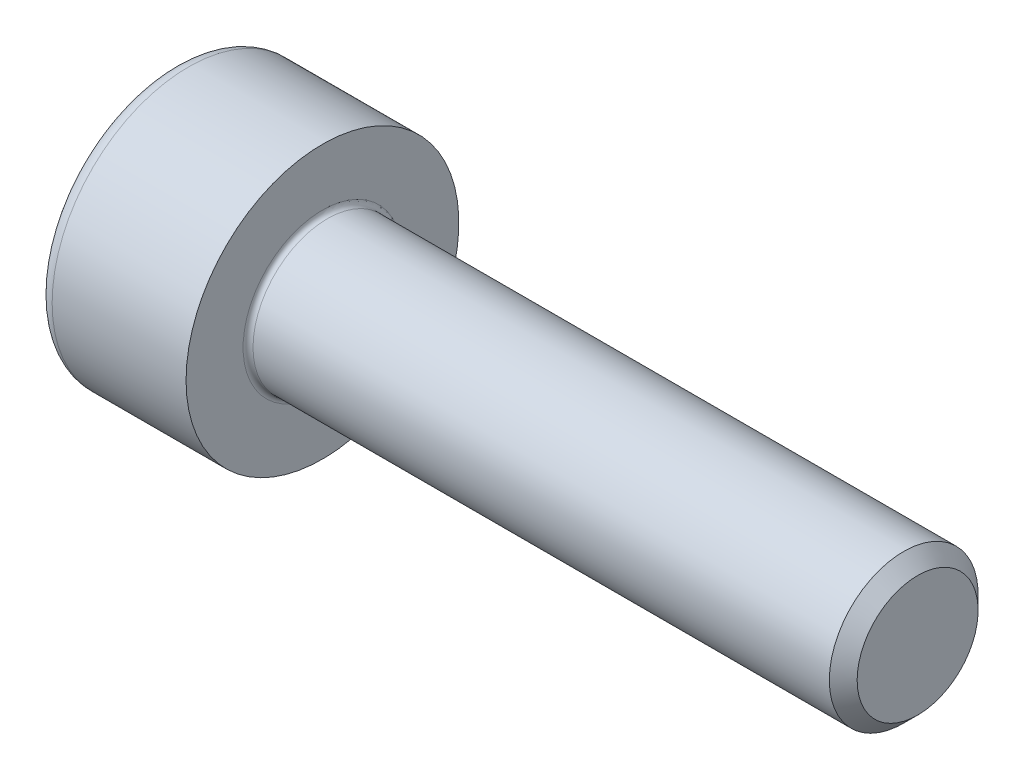
ISO-10303-21;
HEADER;
FILE_DESCRIPTION(('STEP AP214'),'2;1');
FILE_NAME('part.step','',(''),(''),'','','');
FILE_SCHEMA(('AUTOMOTIVE_DESIGN { 1 0 10303 214 1 1 1 1 }'));
ENDSEC;
DATA;
#1=APPLICATION_CONTEXT('core data for automotive mechanical design processes');
#2=APPLICATION_PROTOCOL_DEFINITION('international standard','automotive_design',2000,#1);
#3=PRODUCT_CONTEXT('',#1,'mechanical');
#4=PRODUCT('Part','Part','',(#3));
#5=PRODUCT_RELATED_PRODUCT_CATEGORY('part','',(#4));
#6=PRODUCT_DEFINITION_FORMATION('','',#4);
#7=PRODUCT_DEFINITION_CONTEXT('part definition',#1,'design');
#8=PRODUCT_DEFINITION('design','',#6,#7);
#9=PRODUCT_DEFINITION_SHAPE('','',#8);
#10=(LENGTH_UNIT() NAMED_UNIT(*) SI_UNIT(.MILLI.,.METRE.));
#11=(NAMED_UNIT(*) PLANE_ANGLE_UNIT() SI_UNIT($,.RADIAN.));
#12=(NAMED_UNIT(*) SI_UNIT($,.STERADIAN.) SOLID_ANGLE_UNIT());
#13=UNCERTAINTY_MEASURE_WITH_UNIT(LENGTH_MEASURE(1.E-05),#10,'distance_accuracy_value','');
#14=(GEOMETRIC_REPRESENTATION_CONTEXT(3) GLOBAL_UNCERTAINTY_ASSIGNED_CONTEXT((#13)) GLOBAL_UNIT_ASSIGNED_CONTEXT((#10,
#11,#12)) REPRESENTATION_CONTEXT('',''));
#15=CARTESIAN_POINT('',(0.,0.,0.));
#16=DIRECTION('',(0.,0.,1.));
#17=DIRECTION('',(1.,0.,0.));
#18=AXIS2_PLACEMENT_3D('',#15,#16,#17);
#19=CARTESIAN_POINT('',(0.,0.,0.));
#20=DIRECTION('',(-1.,0.,0.));
#21=DIRECTION('',(0.,0.,1.));
#22=AXIS2_PLACEMENT_3D('',#19,#20,#21);
#23=PLANE('',#22);
#24=DIRECTION('',(0.,-0.499999999999999,0.866025403784439));
#25=VECTOR('',#24,1.);
#26=CARTESIAN_POINT('',(0.,1.45492267835785,0.));
#27=LINE('',#26,#25);
#28=CARTESIAN_POINT('',(0.,1.45492267835785,0.));
#29=VERTEX_POINT('',#28);
#30=CARTESIAN_POINT('',(0.,0.727461339178922,1.26));
#31=VERTEX_POINT('',#30);
#32=EDGE_CURVE('E262',#29,#31,#27,.T.);
#33=ORIENTED_EDGE('',*,*,#32,.T.);
#34=DIRECTION('',(0.,1.,0.));
#35=VECTOR('',#34,1.);
#36=CARTESIAN_POINT('',(0.,-0.727461339178934,1.26));
#37=LINE('',#36,#35);
#38=CARTESIAN_POINT('',(0.,-0.727461339178934,1.26));
#39=VERTEX_POINT('',#38);
#40=EDGE_CURVE('E134',#39,#31,#37,.T.);
#41=ORIENTED_EDGE('',*,*,#40,.F.);
#42=DIRECTION('',(0.,-0.500000000000001,-0.866025403784438));
#43=VECTOR('',#42,1.);
#44=CARTESIAN_POINT('',(0.,-0.727461339178934,1.26));
#45=LINE('',#44,#43);
#46=CARTESIAN_POINT('',(0.,-1.45492267835786,0.));
#47=VERTEX_POINT('',#46);
#48=EDGE_CURVE('E265',#39,#47,#45,.T.);
#49=ORIENTED_EDGE('',*,*,#48,.T.);
#50=DIRECTION('',(0.,0.499999999999998,-0.86602540378444));
#51=VECTOR('',#50,1.);
#52=CARTESIAN_POINT('',(0.,-1.45492267835786,0.));
#53=LINE('',#52,#51);
#54=CARTESIAN_POINT('',(0.,-0.727461339178938,-1.26));
#55=VERTEX_POINT('',#54);
#56=EDGE_CURVE('E268',#47,#55,#53,.T.);
#57=ORIENTED_EDGE('',*,*,#56,.T.);
#58=DIRECTION('',(0.,-1.,0.));
#59=VECTOR('',#58,1.);
#60=CARTESIAN_POINT('',(0.,0.727461339178918,-1.26));
#61=LINE('',#60,#59);
#62=CARTESIAN_POINT('',(0.,0.727461339178918,-1.26));
#63=VERTEX_POINT('',#62);
#64=EDGE_CURVE('E271',#63,#55,#61,.T.);
#65=ORIENTED_EDGE('',*,*,#64,.F.);
#66=DIRECTION('',(0.,-0.500000000000001,-0.866025403784438));
#67=VECTOR('',#66,1.);
#68=CARTESIAN_POINT('',(0.,1.45492267835785,0.));
#69=LINE('',#68,#67);
#70=EDGE_CURVE('E129',#29,#63,#69,.T.);
#71=ORIENTED_EDGE('',*,*,#70,.F.);
#72=EDGE_LOOP('',(#33,#41,#49,#57,#65,#71));
#73=FACE_BOUND('',#72,.T.);
#74=CARTESIAN_POINT('',(0.,0.,0.));
#75=DIRECTION('',(-1.,0.,0.));
#76=DIRECTION('',(0.,0.,1.));
#77=AXIS2_PLACEMENT_3D('',#74,#75,#76);
#78=CIRCLE('',#77,2.45);
#79=CARTESIAN_POINT('',(0.,0.,2.45));
#80=VERTEX_POINT('',#79);
#81=EDGE_CURVE('E46',#80,#80,#78,.T.);
#82=ORIENTED_EDGE('',*,*,#81,.T.);
#83=EDGE_LOOP('',(#82));
#84=FACE_BOUND('',#83,.T.);
#85=ADVANCED_FACE('F38',(#73,#84),#23,.T.);
#86=CARTESIAN_POINT('',(-31.75,0.,0.));
#87=DIRECTION('',(-1.,0.,0.));
#88=DIRECTION('',(0.,0.,1.));
#89=AXIS2_PLACEMENT_3D('',#86,#87,#88);
#90=CYLINDRICAL_SURFACE('',#89,2.75);
#91=CARTESIAN_POINT('',(0.300000000000002,0.,0.));
#92=DIRECTION('',(-1.,0.,0.));
#93=DIRECTION('',(0.,0.,1.));
#94=AXIS2_PLACEMENT_3D('',#91,#92,#93);
#95=CIRCLE('',#94,2.75);
#96=CARTESIAN_POINT('',(0.300000000000002,0.,2.75));
#97=VERTEX_POINT('',#96);
#98=EDGE_CURVE('E11',#97,#97,#95,.F.);
#99=ORIENTED_EDGE('',*,*,#98,.T.);
#100=EDGE_LOOP('',(#99));
#101=FACE_BOUND('',#100,.T.);
#102=CARTESIAN_POINT('',(3.,0.,0.));
#103=DIRECTION('',(-1.,0.,0.));
#104=DIRECTION('',(0.,0.,1.));
#105=AXIS2_PLACEMENT_3D('',#102,#103,#104);
#106=CIRCLE('',#105,2.75);
#107=CARTESIAN_POINT('',(3.,0.,2.75));
#108=VERTEX_POINT('',#107);
#109=EDGE_CURVE('E152',#108,#108,#106,.T.);
#110=ORIENTED_EDGE('',*,*,#109,.T.);
#111=EDGE_LOOP('',(#110));
#112=FACE_BOUND('',#111,.T.);
#113=ADVANCED_FACE('F176',(#101,#112),#90,.T.);
#114=CARTESIAN_POINT('',(3.,2.75,0.));
#115=DIRECTION('',(1.,0.,0.));
#116=DIRECTION('',(0.,0.,-1.));
#117=AXIS2_PLACEMENT_3D('',#114,#115,#116);
#118=PLANE('',#117);
#119=CARTESIAN_POINT('',(3.,0.,0.));
#120=DIRECTION('',(1.,0.,0.));
#121=DIRECTION('',(0.,0.,-1.));
#122=AXIS2_PLACEMENT_3D('',#119,#120,#121);
#123=CIRCLE('',#122,1.59999999999996);
#124=CARTESIAN_POINT('',(3.,0.,-1.59999999999996));
#125=VERTEX_POINT('',#124);
#126=EDGE_CURVE('E155',#125,#125,#123,.F.);
#127=ORIENTED_EDGE('',*,*,#126,.T.);
#128=EDGE_LOOP('',(#127));
#129=FACE_BOUND('',#128,.T.);
#130=ORIENTED_EDGE('',*,*,#109,.F.);
#131=EDGE_LOOP('',(#130));
#132=FACE_BOUND('',#131,.T.);
#133=ADVANCED_FACE('F182',(#129,#132),#118,.T.);
#134=CARTESIAN_POINT('',(-31.75,0.,0.));
#135=DIRECTION('',(-1.,0.,0.));
#136=DIRECTION('',(0.,0.,1.));
#137=AXIS2_PLACEMENT_3D('',#134,#135,#136);
#138=CYLINDRICAL_SURFACE('',#137,1.49999999999996);
#139=CARTESIAN_POINT('',(3.1,0.,0.));
#140=DIRECTION('',(1.,0.,0.));
#141=DIRECTION('',(0.,0.,-1.));
#142=AXIS2_PLACEMENT_3D('',#139,#140,#141);
#143=CIRCLE('',#142,1.49999999999996);
#144=CARTESIAN_POINT('',(3.1,0.,-1.49999999999996));
#145=VERTEX_POINT('',#144);
#146=EDGE_CURVE('E158',#145,#145,#143,.T.);
#147=ORIENTED_EDGE('',*,*,#146,.T.);
#148=EDGE_LOOP('',(#147));
#149=FACE_BOUND('',#148,.T.);
#150=CARTESIAN_POINT('',(14.7194999999999,0.,0.));
#151=DIRECTION('',(-1.,0.,0.));
#152=DIRECTION('',(0.,0.,1.));
#153=AXIS2_PLACEMENT_3D('',#150,#151,#152);
#154=CIRCLE('',#153,1.49999999999992);
#155=CARTESIAN_POINT('',(14.7194999999999,0.,1.49999999999992));
#156=VERTEX_POINT('',#155);
#157=EDGE_CURVE('E149',#156,#156,#154,.T.);
#158=ORIENTED_EDGE('',*,*,#157,.T.);
#159=EDGE_LOOP('',(#158));
#160=FACE_BOUND('',#159,.T.);
#161=ADVANCED_FACE('F188',(#149,#160),#138,.T.);
#162=CARTESIAN_POINT('',(15.,0.,0.));
#163=DIRECTION('',(-1.,0.,0.));
#164=DIRECTION('',(0.,0.,1.));
#165=AXIS2_PLACEMENT_3D('',#162,#163,#164);
#166=CONICAL_SURFACE('',#165,1.2195,0.78539816339716);
#167=ORIENTED_EDGE('',*,*,#157,.F.);
#168=EDGE_LOOP('',(#167));
#169=FACE_BOUND('',#168,.T.);
#170=CARTESIAN_POINT('',(15.,0.,0.));
#171=DIRECTION('',(-1.,0.,0.));
#172=DIRECTION('',(0.,0.,1.));
#173=AXIS2_PLACEMENT_3D('',#170,#171,#172);
#174=CIRCLE('',#173,1.2195);
#175=CARTESIAN_POINT('',(15.,0.,1.2195));
#176=VERTEX_POINT('',#175);
#177=EDGE_CURVE('E145',#176,#176,#174,.T.);
#178=ORIENTED_EDGE('',*,*,#177,.T.);
#179=EDGE_LOOP('',(#178));
#180=FACE_BOUND('',#179,.T.);
#181=ADVANCED_FACE('F192',(#169,#180),#166,.T.);
#182=CARTESIAN_POINT('',(15.,1.2195,0.));
#183=DIRECTION('',(1.,0.,0.));
#184=DIRECTION('',(0.,0.,-1.));
#185=AXIS2_PLACEMENT_3D('',#182,#183,#184);
#186=PLANE('',#185);
#187=ORIENTED_EDGE('',*,*,#177,.F.);
#188=EDGE_LOOP('',(#187));
#189=FACE_BOUND('',#188,.T.);
#190=ADVANCED_FACE('F172',(#189),#186,.T.);
#191=CARTESIAN_POINT('',(3.1,0.,0.));
#192=DIRECTION('',(1.,0.,0.));
#193=DIRECTION('',(0.,0.,-1.));
#194=AXIS2_PLACEMENT_3D('',#191,#192,#193);
#195=TOROIDAL_SURFACE('',#194,1.59999999999996,0.1);
#196=ORIENTED_EDGE('',*,*,#146,.F.);
#197=EDGE_LOOP('',(#196));
#198=FACE_BOUND('',#197,.T.);
#199=ORIENTED_EDGE('',*,*,#126,.F.);
#200=EDGE_LOOP('',(#199));
#201=FACE_BOUND('',#200,.T.);
#202=ADVANCED_FACE('F165',(#198,#201),#195,.F.);
#203=CARTESIAN_POINT('',(0.300000000000002,0.,0.));
#204=DIRECTION('',(-1.,0.,0.));
#205=DIRECTION('',(0.,0.,1.));
#206=AXIS2_PLACEMENT_3D('',#203,#204,#205);
#207=TOROIDAL_SURFACE('',#206,2.45,0.3);
#208=ORIENTED_EDGE('',*,*,#98,.F.);
#209=EDGE_LOOP('',(#208));
#210=FACE_BOUND('',#209,.T.);
#211=ORIENTED_EDGE('',*,*,#81,.F.);
#212=EDGE_LOOP('',(#211));
#213=FACE_BOUND('',#212,.T.);
#214=ADVANCED_FACE('F40',(#210,#213),#207,.T.);
#215=CARTESIAN_POINT('',(1.3,1.45492267835785,0.));
#216=DIRECTION('',(0.,-0.866025403784439,-0.499999999999999));
#217=DIRECTION('',(0.,0.499999999999999,-0.866025403784439));
#218=AXIS2_PLACEMENT_3D('',#215,#216,#217);
#219=PLANE('',#218);
#220=ORIENTED_EDGE('',*,*,#32,.F.);
#221=DIRECTION('',(-1.,0.,0.));
#222=VECTOR('',#221,1.);
#223=CARTESIAN_POINT('',(1.3,1.45492267835785,0.));
#224=LINE('',#223,#222);
#225=CARTESIAN_POINT('',(1.3,1.45492267835785,0.));
#226=VERTEX_POINT('',#225);
#227=EDGE_CURVE('E252',#226,#29,#224,.T.);
#228=ORIENTED_EDGE('',*,*,#227,.F.);
#229=DIRECTION('',(0.,-0.499999999999999,0.866025403784439));
#230=VECTOR('',#229,1.);
#231=CARTESIAN_POINT('',(1.3,1.45492267835785,0.));
#232=LINE('',#231,#230);
#233=CARTESIAN_POINT('',(1.3,1.09119200876839,0.629999999999996));
#234=VERTEX_POINT('',#233);
#235=EDGE_CURVE('E121',#226,#234,#232,.T.);
#236=ORIENTED_EDGE('',*,*,#235,.T.);
#237=CARTESIAN_POINT('',(1.3,0.727461339178922,1.26));
#238=VERTEX_POINT('',#237);
#239=EDGE_CURVE('E112',#234,#238,#232,.T.);
#240=ORIENTED_EDGE('',*,*,#239,.T.);
#241=DIRECTION('',(-1.,0.,0.));
#242=VECTOR('',#241,1.);
#243=CARTESIAN_POINT('',(1.3,0.727461339178922,1.26));
#244=LINE('',#243,#242);
#245=EDGE_CURVE('E126',#238,#31,#244,.T.);
#246=ORIENTED_EDGE('',*,*,#245,.T.);
#247=EDGE_LOOP('',(#220,#228,#236,#240,#246));
#248=FACE_BOUND('',#247,.T.);
#249=ADVANCED_FACE('F125',(#248),#219,.T.);
#250=CARTESIAN_POINT('',(1.3,-0.727461339178934,1.26));
#251=DIRECTION('',(0.,0.,1.));
#252=DIRECTION('',(0.,-1.,0.));
#253=AXIS2_PLACEMENT_3D('',#250,#251,#252);
#254=PLANE('',#253);
#255=ORIENTED_EDGE('',*,*,#40,.T.);
#256=ORIENTED_EDGE('',*,*,#245,.F.);
#257=DIRECTION('',(0.,1.,0.));
#258=VECTOR('',#257,1.);
#259=CARTESIAN_POINT('',(1.3,-0.727461339178934,1.26));
#260=LINE('',#259,#258);
#261=CARTESIAN_POINT('',(1.3,0.,1.26));
#262=VERTEX_POINT('',#261);
#263=EDGE_CURVE('E109',#262,#238,#260,.T.);
#264=ORIENTED_EDGE('',*,*,#263,.F.);
#265=CARTESIAN_POINT('',(1.3,-0.727461339178934,1.26));
#266=VERTEX_POINT('',#265);
#267=EDGE_CURVE('E120',#266,#262,#260,.T.);
#268=ORIENTED_EDGE('',*,*,#267,.F.);
#269=DIRECTION('',(-1.,0.,0.));
#270=VECTOR('',#269,1.);
#271=CARTESIAN_POINT('',(1.3,-0.727461339178934,1.26));
#272=LINE('',#271,#270);
#273=EDGE_CURVE('E136',#266,#39,#272,.T.);
#274=ORIENTED_EDGE('',*,*,#273,.T.);
#275=EDGE_LOOP('',(#255,#256,#264,#268,#274));
#276=FACE_BOUND('',#275,.T.);
#277=ADVANCED_FACE('F131',(#276),#254,.F.);
#278=CARTESIAN_POINT('',(1.3,-0.727461339178934,1.26));
#279=DIRECTION('',(0.,0.866025403784438,-0.500000000000001));
#280=DIRECTION('',(0.,0.500000000000001,0.866025403784438));
#281=AXIS2_PLACEMENT_3D('',#278,#279,#280);
#282=PLANE('',#281);
#283=ORIENTED_EDGE('',*,*,#48,.F.);
#284=ORIENTED_EDGE('',*,*,#273,.F.);
#285=DIRECTION('',(0.,-0.500000000000001,-0.866025403784438));
#286=VECTOR('',#285,1.);
#287=CARTESIAN_POINT('',(1.3,-0.727461339178934,1.26));
#288=LINE('',#287,#286);
#289=CARTESIAN_POINT('',(1.3,-1.0911920087684,0.630000000000005));
#290=VERTEX_POINT('',#289);
#291=EDGE_CURVE('E291',#266,#290,#288,.T.);
#292=ORIENTED_EDGE('',*,*,#291,.T.);
#293=CARTESIAN_POINT('',(1.3,-1.45492267835786,0.));
#294=VERTEX_POINT('',#293);
#295=EDGE_CURVE('E280',#290,#294,#288,.T.);
#296=ORIENTED_EDGE('',*,*,#295,.T.);
#297=DIRECTION('',(-1.,0.,0.));
#298=VECTOR('',#297,1.);
#299=CARTESIAN_POINT('',(1.3,-1.45492267835786,0.));
#300=LINE('',#299,#298);
#301=EDGE_CURVE('E141',#294,#47,#300,.T.);
#302=ORIENTED_EDGE('',*,*,#301,.T.);
#303=EDGE_LOOP('',(#283,#284,#292,#296,#302));
#304=FACE_BOUND('',#303,.T.);
#305=ADVANCED_FACE('F206',(#304),#282,.T.);
#306=CARTESIAN_POINT('',(1.3,-1.45492267835786,0.));
#307=DIRECTION('',(0.,0.86602540378444,0.499999999999998));
#308=DIRECTION('',(0.,-0.499999999999998,0.86602540378444));
#309=AXIS2_PLACEMENT_3D('',#306,#307,#308);
#310=PLANE('',#309);
#311=ORIENTED_EDGE('',*,*,#56,.F.);
#312=ORIENTED_EDGE('',*,*,#301,.F.);
#313=DIRECTION('',(0.,0.499999999999998,-0.86602540378444));
#314=VECTOR('',#313,1.);
#315=CARTESIAN_POINT('',(1.3,-1.45492267835786,0.));
#316=LINE('',#315,#314);
#317=CARTESIAN_POINT('',(1.3,-1.0911920087684,-0.63));
#318=VERTEX_POINT('',#317);
#319=EDGE_CURVE('E258',#294,#318,#316,.T.);
#320=ORIENTED_EDGE('',*,*,#319,.T.);
#321=CARTESIAN_POINT('',(1.3,-0.727461339178938,-1.26));
#322=VERTEX_POINT('',#321);
#323=EDGE_CURVE('E290',#318,#322,#316,.T.);
#324=ORIENTED_EDGE('',*,*,#323,.T.);
#325=DIRECTION('',(-1.,0.,0.));
#326=VECTOR('',#325,1.);
#327=CARTESIAN_POINT('',(1.3,-0.727461339178938,-1.26));
#328=LINE('',#327,#326);
#329=EDGE_CURVE('E251',#322,#55,#328,.T.);
#330=ORIENTED_EDGE('',*,*,#329,.T.);
#331=EDGE_LOOP('',(#311,#312,#320,#324,#330));
#332=FACE_BOUND('',#331,.T.);
#333=ADVANCED_FACE('F209',(#332),#310,.T.);
#334=CARTESIAN_POINT('',(1.3,0.727461339178918,-1.26));
#335=DIRECTION('',(0.,0.,-1.));
#336=DIRECTION('',(0.,1.,0.));
#337=AXIS2_PLACEMENT_3D('',#334,#335,#336);
#338=PLANE('',#337);
#339=ORIENTED_EDGE('',*,*,#64,.T.);
#340=ORIENTED_EDGE('',*,*,#329,.F.);
#341=DIRECTION('',(0.,-1.,0.));
#342=VECTOR('',#341,1.);
#343=CARTESIAN_POINT('',(1.3,0.727461339178918,-1.26));
#344=LINE('',#343,#342);
#345=CARTESIAN_POINT('',(1.3,0.,-1.26));
#346=VERTEX_POINT('',#345);
#347=EDGE_CURVE('E255',#346,#322,#344,.T.);
#348=ORIENTED_EDGE('',*,*,#347,.F.);
#349=CARTESIAN_POINT('',(1.3,0.727461339178918,-1.26));
#350=VERTEX_POINT('',#349);
#351=EDGE_CURVE('E53',#350,#346,#344,.T.);
#352=ORIENTED_EDGE('',*,*,#351,.F.);
#353=DIRECTION('',(-1.,0.,0.));
#354=VECTOR('',#353,1.);
#355=CARTESIAN_POINT('',(1.3,0.727461339178918,-1.26));
#356=LINE('',#355,#354);
#357=EDGE_CURVE('E248',#350,#63,#356,.T.);
#358=ORIENTED_EDGE('',*,*,#357,.T.);
#359=EDGE_LOOP('',(#339,#340,#348,#352,#358));
#360=FACE_BOUND('',#359,.T.);
#361=ADVANCED_FACE('F213',(#360),#338,.F.);
#362=CARTESIAN_POINT('',(1.3,1.45492267835785,0.));
#363=DIRECTION('',(0.,0.866025403784438,-0.500000000000001));
#364=DIRECTION('',(0.,0.500000000000001,0.866025403784438));
#365=AXIS2_PLACEMENT_3D('',#362,#363,#364);
#366=PLANE('',#365);
#367=ORIENTED_EDGE('',*,*,#70,.T.);
#368=ORIENTED_EDGE('',*,*,#357,.F.);
#369=DIRECTION('',(0.,-0.500000000000001,-0.866025403784438));
#370=VECTOR('',#369,1.);
#371=CARTESIAN_POINT('',(1.3,1.45492267835785,0.));
#372=LINE('',#371,#370);
#373=CARTESIAN_POINT('',(1.3,1.09119200876838,-0.629999999999997));
#374=VERTEX_POINT('',#373);
#375=EDGE_CURVE('E238',#374,#350,#372,.T.);
#376=ORIENTED_EDGE('',*,*,#375,.F.);
#377=EDGE_CURVE('E244',#226,#374,#372,.T.);
#378=ORIENTED_EDGE('',*,*,#377,.F.);
#379=ORIENTED_EDGE('',*,*,#227,.T.);
#380=EDGE_LOOP('',(#367,#368,#376,#378,#379));
#381=FACE_BOUND('',#380,.T.);
#382=ADVANCED_FACE('F217',(#381),#366,.F.);
#383=CARTESIAN_POINT('',(1.3,2.18238401753677,-1.26));
#384=DIRECTION('',(1.,0.,0.));
#385=DIRECTION('',(0.,0.,-1.));
#386=AXIS2_PLACEMENT_3D('',#383,#384,#385);
#387=PLANE('',#386);
#388=ORIENTED_EDGE('',*,*,#347,.T.);
#389=ORIENTED_EDGE('',*,*,#323,.F.);
#390=CARTESIAN_POINT('',(1.3,0.,0.));
#391=DIRECTION('',(-1.,0.,0.));
#392=DIRECTION('',(0.,0.,1.));
#393=AXIS2_PLACEMENT_3D('',#390,#391,#392);
#394=CIRCLE('',#393,1.26);
#395=EDGE_CURVE('E286',#346,#318,#394,.T.);
#396=ORIENTED_EDGE('',*,*,#395,.F.);
#397=EDGE_LOOP('',(#388,#389,#396));
#398=FACE_BOUND('',#397,.T.);
#399=ADVANCED_FACE('F221',(#398),#387,.F.);
#400=ORIENTED_EDGE('',*,*,#319,.F.);
#401=ORIENTED_EDGE('',*,*,#295,.F.);
#402=EDGE_CURVE('E139',#318,#290,#394,.T.);
#403=ORIENTED_EDGE('',*,*,#402,.F.);
#404=EDGE_LOOP('',(#400,#401,#403));
#405=FACE_BOUND('',#404,.T.);
#406=ADVANCED_FACE('F224',(#405),#387,.F.);
#407=ORIENTED_EDGE('',*,*,#291,.F.);
#408=ORIENTED_EDGE('',*,*,#267,.T.);
#409=EDGE_CURVE('E135',#290,#262,#394,.T.);
#410=ORIENTED_EDGE('',*,*,#409,.F.);
#411=EDGE_LOOP('',(#407,#408,#410));
#412=FACE_BOUND('',#411,.T.);
#413=ADVANCED_FACE('F229',(#412),#387,.F.);
#414=ORIENTED_EDGE('',*,*,#263,.T.);
#415=ORIENTED_EDGE('',*,*,#239,.F.);
#416=EDGE_CURVE('E115',#262,#234,#394,.T.);
#417=ORIENTED_EDGE('',*,*,#416,.F.);
#418=EDGE_LOOP('',(#414,#415,#417));
#419=FACE_BOUND('',#418,.T.);
#420=ADVANCED_FACE('F111',(#419),#387,.F.);
#421=ORIENTED_EDGE('',*,*,#235,.F.);
#422=ORIENTED_EDGE('',*,*,#377,.T.);
#423=EDGE_CURVE('E146',#234,#374,#394,.T.);
#424=ORIENTED_EDGE('',*,*,#423,.F.);
#425=EDGE_LOOP('',(#421,#422,#424));
#426=FACE_BOUND('',#425,.T.);
#427=ADVANCED_FACE('F232',(#426),#387,.F.);
#428=ORIENTED_EDGE('',*,*,#375,.T.);
#429=ORIENTED_EDGE('',*,*,#351,.T.);
#430=EDGE_CURVE('E241',#374,#346,#394,.T.);
#431=ORIENTED_EDGE('',*,*,#430,.F.);
#432=EDGE_LOOP('',(#428,#429,#431));
#433=FACE_BOUND('',#432,.T.);
#434=ADVANCED_FACE('F202',(#433),#387,.F.);
#435=CARTESIAN_POINT('',(1.3,0.,0.));
#436=DIRECTION('',(-1.,0.,0.));
#437=DIRECTION('',(0.,0.,1.));
#438=AXIS2_PLACEMENT_3D('',#435,#436,#437);
#439=CONICAL_SURFACE('',#438,1.26,1.04719755119659);
#440=CARTESIAN_POINT('',(2.02746133917894,0.,0.));
#441=VERTEX_POINT('',#440);
#442=VERTEX_LOOP('',#441);
#443=FACE_BOUND('',#442,.T.);
#444=ORIENTED_EDGE('',*,*,#416,.T.);
#445=ORIENTED_EDGE('',*,*,#423,.T.);
#446=ORIENTED_EDGE('',*,*,#430,.T.);
#447=ORIENTED_EDGE('',*,*,#395,.T.);
#448=ORIENTED_EDGE('',*,*,#402,.T.);
#449=ORIENTED_EDGE('',*,*,#409,.T.);
#450=EDGE_LOOP('',(#444,#445,#446,#447,#448,#449));
#451=FACE_BOUND('',#450,.T.);
#452=ADVANCED_FACE('F200',(#443,#451),#439,.F.);
#453=CLOSED_SHELL('',(#85,#113,#133,#161,#181,#190,#202,#214,#249,#277,#305,#333,#361,#382,#399,
#406,#413,#420,#427,#434,#452));
#454=MANIFOLD_SOLID_BREP('B2',#453);
#455=ADVANCED_BREP_SHAPE_REPRESENTATION('',(#18,#454),#14);
#456=SHAPE_DEFINITION_REPRESENTATION(#9,#455);
ENDSEC;
END-ISO-10303-21;
